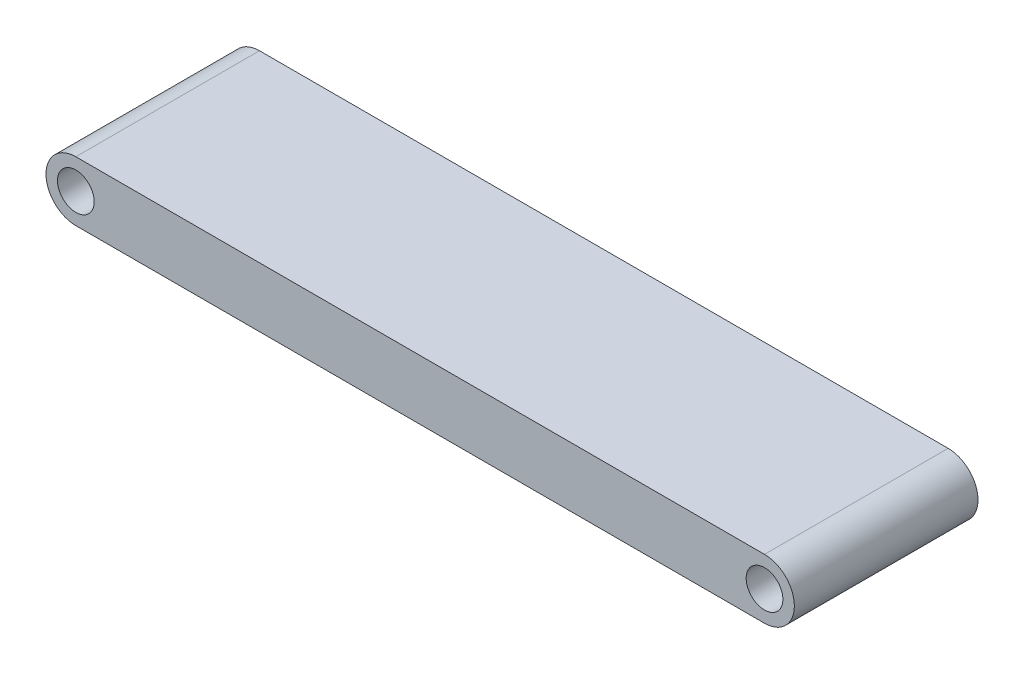
ISO-10303-21;
HEADER;
FILE_DESCRIPTION(('STEP AP214'),'2;1');
FILE_NAME('part.step','',(''),(''),'','','');
FILE_SCHEMA(('AUTOMOTIVE_DESIGN { 1 0 10303 214 1 1 1 1 }'));
ENDSEC;
DATA;
#1=APPLICATION_CONTEXT('core data for automotive mechanical design processes');
#2=APPLICATION_PROTOCOL_DEFINITION('international standard','automotive_design',2000,#1);
#3=PRODUCT_CONTEXT('',#1,'mechanical');
#4=PRODUCT('Part','Part','',(#3));
#5=PRODUCT_RELATED_PRODUCT_CATEGORY('part','',(#4));
#6=PRODUCT_DEFINITION_FORMATION('','',#4);
#7=PRODUCT_DEFINITION_CONTEXT('part definition',#1,'design');
#8=PRODUCT_DEFINITION('design','',#6,#7);
#9=PRODUCT_DEFINITION_SHAPE('','',#8);
#10=(LENGTH_UNIT() NAMED_UNIT(*) SI_UNIT(.MILLI.,.METRE.));
#11=(NAMED_UNIT(*) PLANE_ANGLE_UNIT() SI_UNIT($,.RADIAN.));
#12=(NAMED_UNIT(*) SI_UNIT($,.STERADIAN.) SOLID_ANGLE_UNIT());
#13=UNCERTAINTY_MEASURE_WITH_UNIT(LENGTH_MEASURE(1.E-05),#10,'distance_accuracy_value','');
#14=(GEOMETRIC_REPRESENTATION_CONTEXT(3) GLOBAL_UNCERTAINTY_ASSIGNED_CONTEXT((#13)) GLOBAL_UNIT_ASSIGNED_CONTEXT((#10,
#11,#12)) REPRESENTATION_CONTEXT('',''));
#15=CARTESIAN_POINT('',(0.,0.,0.));
#16=DIRECTION('',(0.,0.,1.));
#17=DIRECTION('',(1.,0.,0.));
#18=AXIS2_PLACEMENT_3D('',#15,#16,#17);
#19=CARTESIAN_POINT('',(-3.35528380754993,0.,40.));
#20=DIRECTION('',(0.,0.,1.));
#21=DIRECTION('',(1.,0.,0.));
#22=AXIS2_PLACEMENT_3D('',#19,#20,#21);
#23=PLANE('',#22);
#24=CARTESIAN_POINT('',(-3.35528380754993,0.,40.));
#25=DIRECTION('',(0.,0.,1.));
#26=DIRECTION('',(1.,0.,0.));
#27=AXIS2_PLACEMENT_3D('',#24,#25,#26);
#28=CIRCLE('',#27,4.);
#29=CARTESIAN_POINT('',(0.644716192450066,0.,40.));
#30=VERTEX_POINT('',#29);
#31=EDGE_CURVE('E112',#30,#30,#28,.T.);
#32=ORIENTED_EDGE('',*,*,#31,.F.);
#33=EDGE_LOOP('',(#32));
#34=FACE_BOUND('',#33,.T.);
#35=CARTESIAN_POINT('',(-3.35528380754993,0.,40.));
#36=DIRECTION('',(0.,0.,1.));
#37=DIRECTION('',(1.,0.,0.));
#38=AXIS2_PLACEMENT_3D('',#35,#36,#37);
#39=CIRCLE('',#38,6.5);
#40=CARTESIAN_POINT('',(-3.35528380754993,6.5,40.));
#41=VERTEX_POINT('',#40);
#42=CARTESIAN_POINT('',(-3.35528380754993,-6.5,40.));
#43=VERTEX_POINT('',#42);
#44=EDGE_CURVE('E92',#41,#43,#39,.T.);
#45=ORIENTED_EDGE('',*,*,#44,.T.);
#46=DIRECTION('',(1.,0.,0.));
#47=VECTOR('',#46,1.);
#48=CARTESIAN_POINT('',(-3.35528380754993,-6.5,40.));
#49=LINE('',#48,#47);
#50=CARTESIAN_POINT('',(146.64471619245,-6.5,40.));
#51=VERTEX_POINT('',#50);
#52=EDGE_CURVE('E87',#43,#51,#49,.T.);
#53=ORIENTED_EDGE('',*,*,#52,.T.);
#54=CARTESIAN_POINT('',(146.64471619245,0.,40.));
#55=DIRECTION('',(0.,0.,1.));
#56=DIRECTION('',(1.,0.,0.));
#57=AXIS2_PLACEMENT_3D('',#54,#55,#56);
#58=CIRCLE('',#57,6.5);
#59=CARTESIAN_POINT('',(146.64471619245,6.5,40.));
#60=VERTEX_POINT('',#59);
#61=EDGE_CURVE('E90',#51,#60,#58,.T.);
#62=ORIENTED_EDGE('',*,*,#61,.T.);
#63=DIRECTION('',(-1.,0.,0.));
#64=VECTOR('',#63,1.);
#65=CARTESIAN_POINT('',(-3.35528380754993,6.5,40.));
#66=LINE('',#65,#64);
#67=EDGE_CURVE('E57',#60,#41,#66,.T.);
#68=ORIENTED_EDGE('',*,*,#67,.T.);
#69=EDGE_LOOP('',(#45,#53,#62,#68));
#70=FACE_BOUND('',#69,.T.);
#71=CARTESIAN_POINT('',(146.64471619245,0.,40.));
#72=DIRECTION('',(0.,0.,1.));
#73=DIRECTION('',(1.,0.,0.));
#74=AXIS2_PLACEMENT_3D('',#71,#72,#73);
#75=CIRCLE('',#74,3.99999999999999);
#76=CARTESIAN_POINT('',(150.64471619245,0.,40.));
#77=VERTEX_POINT('',#76);
#78=EDGE_CURVE('E134',#77,#77,#75,.T.);
#79=ORIENTED_EDGE('',*,*,#78,.F.);
#80=EDGE_LOOP('',(#79));
#81=FACE_BOUND('',#80,.T.);
#82=ADVANCED_FACE('F39',(#34,#70,#81),#23,.T.);
#83=CARTESIAN_POINT('',(-3.35528380754993,0.,0.));
#84=DIRECTION('',(0.,0.,1.));
#85=DIRECTION('',(1.,0.,0.));
#86=AXIS2_PLACEMENT_3D('',#83,#84,#85);
#87=PLANE('',#86);
#88=CARTESIAN_POINT('',(-3.35528380754993,0.,0.));
#89=DIRECTION('',(0.,0.,1.));
#90=DIRECTION('',(1.,0.,0.));
#91=AXIS2_PLACEMENT_3D('',#88,#89,#90);
#92=CIRCLE('',#91,6.5);
#93=CARTESIAN_POINT('',(-3.35528380754993,6.5,0.));
#94=VERTEX_POINT('',#93);
#95=CARTESIAN_POINT('',(-3.35528380754993,-6.5,0.));
#96=VERTEX_POINT('',#95);
#97=EDGE_CURVE('E108',#94,#96,#92,.T.);
#98=ORIENTED_EDGE('',*,*,#97,.F.);
#99=DIRECTION('',(-1.,0.,0.));
#100=VECTOR('',#99,1.);
#101=CARTESIAN_POINT('',(-3.35528380754993,6.5,0.));
#102=LINE('',#101,#100);
#103=CARTESIAN_POINT('',(146.64471619245,6.5,0.));
#104=VERTEX_POINT('',#103);
#105=EDGE_CURVE('E80',#104,#94,#102,.T.);
#106=ORIENTED_EDGE('',*,*,#105,.F.);
#107=CARTESIAN_POINT('',(146.64471619245,0.,0.));
#108=DIRECTION('',(0.,0.,1.));
#109=DIRECTION('',(1.,0.,0.));
#110=AXIS2_PLACEMENT_3D('',#107,#108,#109);
#111=CIRCLE('',#110,6.5);
#112=CARTESIAN_POINT('',(146.64471619245,-6.5,0.));
#113=VERTEX_POINT('',#112);
#114=EDGE_CURVE('E74',#113,#104,#111,.T.);
#115=ORIENTED_EDGE('',*,*,#114,.F.);
#116=DIRECTION('',(1.,0.,0.));
#117=VECTOR('',#116,1.);
#118=CARTESIAN_POINT('',(-3.35528380754993,-6.5,0.));
#119=LINE('',#118,#117);
#120=EDGE_CURVE('E97',#96,#113,#119,.T.);
#121=ORIENTED_EDGE('',*,*,#120,.F.);
#122=EDGE_LOOP('',(#98,#106,#115,#121));
#123=FACE_BOUND('',#122,.T.);
#124=CARTESIAN_POINT('',(-3.35528380754993,0.,0.));
#125=DIRECTION('',(0.,0.,1.));
#126=DIRECTION('',(1.,0.,0.));
#127=AXIS2_PLACEMENT_3D('',#124,#125,#126);
#128=CIRCLE('',#127,4.);
#129=CARTESIAN_POINT('',(0.644716192450066,0.,0.));
#130=VERTEX_POINT('',#129);
#131=EDGE_CURVE('E130',#130,#130,#128,.T.);
#132=ORIENTED_EDGE('',*,*,#131,.T.);
#133=EDGE_LOOP('',(#132));
#134=FACE_BOUND('',#133,.T.);
#135=CARTESIAN_POINT('',(146.64471619245,0.,0.));
#136=DIRECTION('',(0.,0.,1.));
#137=DIRECTION('',(1.,0.,0.));
#138=AXIS2_PLACEMENT_3D('',#135,#136,#137);
#139=CIRCLE('',#138,3.99999999999999);
#140=CARTESIAN_POINT('',(150.64471619245,0.,0.));
#141=VERTEX_POINT('',#140);
#142=EDGE_CURVE('E138',#141,#141,#139,.T.);
#143=ORIENTED_EDGE('',*,*,#142,.T.);
#144=EDGE_LOOP('',(#143));
#145=FACE_BOUND('',#144,.T.);
#146=ADVANCED_FACE('F125',(#123,#134,#145),#87,.F.);
#147=CARTESIAN_POINT('',(-3.35528380754993,0.,40.));
#148=DIRECTION('',(0.,0.,-1.));
#149=DIRECTION('',(-1.,0.,0.));
#150=AXIS2_PLACEMENT_3D('',#147,#148,#149);
#151=CYLINDRICAL_SURFACE('',#150,6.5);
#152=ORIENTED_EDGE('',*,*,#97,.T.);
#153=DIRECTION('',(0.,0.,-1.));
#154=VECTOR('',#153,1.);
#155=CARTESIAN_POINT('',(-3.35528380754993,-6.5,40.));
#156=LINE('',#155,#154);
#157=EDGE_CURVE('E11',#43,#96,#156,.T.);
#158=ORIENTED_EDGE('',*,*,#157,.F.);
#159=ORIENTED_EDGE('',*,*,#44,.F.);
#160=DIRECTION('',(0.,0.,-1.));
#161=VECTOR('',#160,1.);
#162=CARTESIAN_POINT('',(-3.35528380754993,6.5,40.));
#163=LINE('',#162,#161);
#164=EDGE_CURVE('E104',#41,#94,#163,.T.);
#165=ORIENTED_EDGE('',*,*,#164,.T.);
#166=EDGE_LOOP('',(#152,#158,#159,#165));
#167=FACE_BOUND('',#166,.T.);
#168=ADVANCED_FACE('F41',(#167),#151,.T.);
#169=CARTESIAN_POINT('',(-3.35528380754993,-6.5,40.));
#170=DIRECTION('',(0.,1.,0.));
#171=DIRECTION('',(0.,0.,1.));
#172=AXIS2_PLACEMENT_3D('',#169,#170,#171);
#173=PLANE('',#172);
#174=ORIENTED_EDGE('',*,*,#120,.T.);
#175=DIRECTION('',(0.,0.,-1.));
#176=VECTOR('',#175,1.);
#177=CARTESIAN_POINT('',(146.64471619245,-6.5,40.));
#178=LINE('',#177,#176);
#179=EDGE_CURVE('E49',#51,#113,#178,.T.);
#180=ORIENTED_EDGE('',*,*,#179,.F.);
#181=ORIENTED_EDGE('',*,*,#52,.F.);
#182=ORIENTED_EDGE('',*,*,#157,.T.);
#183=EDGE_LOOP('',(#174,#180,#181,#182));
#184=FACE_BOUND('',#183,.T.);
#185=ADVANCED_FACE('F96',(#184),#173,.F.);
#186=CARTESIAN_POINT('',(146.64471619245,0.,40.));
#187=DIRECTION('',(0.,0.,-1.));
#188=DIRECTION('',(-1.,0.,0.));
#189=AXIS2_PLACEMENT_3D('',#186,#187,#188);
#190=CYLINDRICAL_SURFACE('',#189,6.5);
#191=ORIENTED_EDGE('',*,*,#114,.T.);
#192=DIRECTION('',(0.,0.,-1.));
#193=VECTOR('',#192,1.);
#194=CARTESIAN_POINT('',(146.64471619245,6.5,40.));
#195=LINE('',#194,#193);
#196=EDGE_CURVE('E99',#60,#104,#195,.T.);
#197=ORIENTED_EDGE('',*,*,#196,.F.);
#198=ORIENTED_EDGE('',*,*,#61,.F.);
#199=ORIENTED_EDGE('',*,*,#179,.T.);
#200=EDGE_LOOP('',(#191,#197,#198,#199));
#201=FACE_BOUND('',#200,.T.);
#202=ADVANCED_FACE('F100',(#201),#190,.T.);
#203=CARTESIAN_POINT('',(-3.35528380754993,6.5,40.));
#204=DIRECTION('',(0.,-1.,0.));
#205=DIRECTION('',(0.,0.,-1.));
#206=AXIS2_PLACEMENT_3D('',#203,#204,#205);
#207=PLANE('',#206);
#208=ORIENTED_EDGE('',*,*,#105,.T.);
#209=ORIENTED_EDGE('',*,*,#164,.F.);
#210=ORIENTED_EDGE('',*,*,#67,.F.);
#211=ORIENTED_EDGE('',*,*,#196,.T.);
#212=EDGE_LOOP('',(#208,#209,#210,#211));
#213=FACE_BOUND('',#212,.T.);
#214=ADVANCED_FACE('F122',(#213),#207,.F.);
#215=CARTESIAN_POINT('',(-3.35528380754993,0.,40.));
#216=DIRECTION('',(0.,0.,-1.));
#217=DIRECTION('',(-1.,0.,0.));
#218=AXIS2_PLACEMENT_3D('',#215,#216,#217);
#219=CYLINDRICAL_SURFACE('',#218,4.);
#220=ORIENTED_EDGE('',*,*,#31,.T.);
#221=EDGE_LOOP('',(#220));
#222=FACE_BOUND('',#221,.T.);
#223=ORIENTED_EDGE('',*,*,#131,.F.);
#224=EDGE_LOOP('',(#223));
#225=FACE_BOUND('',#224,.T.);
#226=ADVANCED_FACE('F157',(#222,#225),#219,.F.);
#227=CARTESIAN_POINT('',(146.64471619245,0.,40.));
#228=DIRECTION('',(0.,0.,-1.));
#229=DIRECTION('',(-1.,0.,0.));
#230=AXIS2_PLACEMENT_3D('',#227,#228,#229);
#231=CYLINDRICAL_SURFACE('',#230,3.99999999999999);
#232=ORIENTED_EDGE('',*,*,#78,.T.);
#233=EDGE_LOOP('',(#232));
#234=FACE_BOUND('',#233,.T.);
#235=ORIENTED_EDGE('',*,*,#142,.F.);
#236=EDGE_LOOP('',(#235));
#237=FACE_BOUND('',#236,.T.);
#238=ADVANCED_FACE('F146',(#234,#237),#231,.F.);
#239=CLOSED_SHELL('',(#82,#146,#168,#185,#202,#214,#226,#238));
#240=MANIFOLD_SOLID_BREP('B2',#239);
#241=ADVANCED_BREP_SHAPE_REPRESENTATION('',(#18,#240),#14);
#242=SHAPE_DEFINITION_REPRESENTATION(#9,#241);
ENDSEC;
END-ISO-10303-21;
